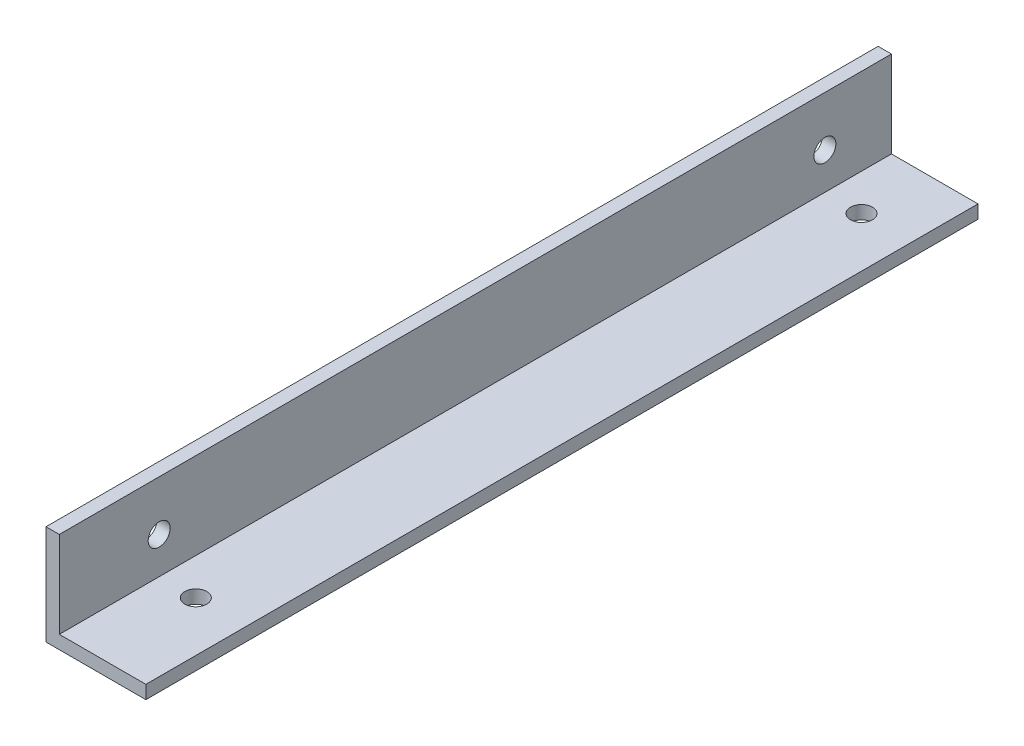
ISO-10303-21;
HEADER;
FILE_DESCRIPTION(('STEP AP214'),'2;1');
FILE_NAME('part.step','',(''),(''),'','','');
FILE_SCHEMA(('AUTOMOTIVE_DESIGN { 1 0 10303 214 1 1 1 1 }'));
ENDSEC;
DATA;
#1=APPLICATION_CONTEXT('core data for automotive mechanical design processes');
#2=APPLICATION_PROTOCOL_DEFINITION('international standard','automotive_design',2000,#1);
#3=PRODUCT_CONTEXT('',#1,'mechanical');
#4=PRODUCT('Part','Part','',(#3));
#5=PRODUCT_RELATED_PRODUCT_CATEGORY('part','',(#4));
#6=PRODUCT_DEFINITION_FORMATION('','',#4);
#7=PRODUCT_DEFINITION_CONTEXT('part definition',#1,'design');
#8=PRODUCT_DEFINITION('design','',#6,#7);
#9=PRODUCT_DEFINITION_SHAPE('','',#8);
#10=(LENGTH_UNIT() NAMED_UNIT(*) SI_UNIT(.MILLI.,.METRE.));
#11=(NAMED_UNIT(*) PLANE_ANGLE_UNIT() SI_UNIT($,.RADIAN.));
#12=(NAMED_UNIT(*) SI_UNIT($,.STERADIAN.) SOLID_ANGLE_UNIT());
#13=UNCERTAINTY_MEASURE_WITH_UNIT(LENGTH_MEASURE(1.E-05),#10,'distance_accuracy_value','');
#14=(GEOMETRIC_REPRESENTATION_CONTEXT(3) GLOBAL_UNCERTAINTY_ASSIGNED_CONTEXT((#13)) GLOBAL_UNIT_ASSIGNED_CONTEXT((#10,
#11,#12)) REPRESENTATION_CONTEXT('',''));
#15=CARTESIAN_POINT('',(0.,0.,0.));
#16=DIRECTION('',(0.,0.,1.));
#17=DIRECTION('',(1.,0.,0.));
#18=AXIS2_PLACEMENT_3D('',#15,#16,#17);
#19=CARTESIAN_POINT('',(0.,15.,125.));
#20=DIRECTION('',(1.,0.,0.));
#21=DIRECTION('',(0.,0.,-1.));
#22=AXIS2_PLACEMENT_3D('',#19,#20,#21);
#23=PLANE('',#22);
#24=CARTESIAN_POINT('',(0.,7.5,110.));
#25=DIRECTION('',(-1.,0.,0.));
#26=DIRECTION('',(0.,0.,1.));
#27=AXIS2_PLACEMENT_3D('',#24,#25,#26);
#28=CIRCLE('',#27,1.65);
#29=CARTESIAN_POINT('',(0.,7.5,111.65));
#30=VERTEX_POINT('',#29);
#31=EDGE_CURVE('E164',#30,#30,#28,.T.);
#32=ORIENTED_EDGE('',*,*,#31,.F.);
#33=EDGE_LOOP('',(#32));
#34=FACE_BOUND('',#33,.T.);
#35=CARTESIAN_POINT('',(0.,7.5,10.));
#36=DIRECTION('',(-1.,0.,0.));
#37=DIRECTION('',(0.,0.,1.));
#38=AXIS2_PLACEMENT_3D('',#35,#36,#37);
#39=CIRCLE('',#38,1.65);
#40=CARTESIAN_POINT('',(0.,7.5,11.65));
#41=VERTEX_POINT('',#40);
#42=EDGE_CURVE('E167',#41,#41,#39,.T.);
#43=ORIENTED_EDGE('',*,*,#42,.F.);
#44=EDGE_LOOP('',(#43));
#45=FACE_BOUND('',#44,.T.);
#46=DIRECTION('',(0.,-1.,0.));
#47=VECTOR('',#46,1.);
#48=CARTESIAN_POINT('',(0.,15.,0.));
#49=LINE('',#48,#47);
#50=CARTESIAN_POINT('',(0.,15.,0.));
#51=VERTEX_POINT('',#50);
#52=CARTESIAN_POINT('',(0.,0.,0.));
#53=VERTEX_POINT('',#52);
#54=EDGE_CURVE('E119',#51,#53,#49,.T.);
#55=ORIENTED_EDGE('',*,*,#54,.T.);
#56=DIRECTION('',(0.,0.,-1.));
#57=VECTOR('',#56,1.);
#58=CARTESIAN_POINT('',(0.,0.,125.));
#59=LINE('',#58,#57);
#60=CARTESIAN_POINT('',(0.,0.,125.));
#61=VERTEX_POINT('',#60);
#62=EDGE_CURVE('E11',#61,#53,#59,.T.);
#63=ORIENTED_EDGE('',*,*,#62,.F.);
#64=DIRECTION('',(0.,-1.,0.));
#65=VECTOR('',#64,1.);
#66=CARTESIAN_POINT('',(0.,15.,125.));
#67=LINE('',#66,#65);
#68=CARTESIAN_POINT('',(0.,15.,125.));
#69=VERTEX_POINT('',#68);
#70=EDGE_CURVE('E130',#69,#61,#67,.T.);
#71=ORIENTED_EDGE('',*,*,#70,.F.);
#72=DIRECTION('',(0.,0.,-1.));
#73=VECTOR('',#72,1.);
#74=CARTESIAN_POINT('',(0.,15.,125.));
#75=LINE('',#74,#73);
#76=EDGE_CURVE('E115',#69,#51,#75,.T.);
#77=ORIENTED_EDGE('',*,*,#76,.T.);
#78=EDGE_LOOP('',(#55,#63,#71,#77));
#79=FACE_BOUND('',#78,.T.);
#80=ADVANCED_FACE('F35',(#34,#45,#79),#23,.F.);
#81=CARTESIAN_POINT('',(0.,0.,125.));
#82=DIRECTION('',(0.,1.,0.));
#83=DIRECTION('',(0.,0.,1.));
#84=AXIS2_PLACEMENT_3D('',#81,#82,#83);
#85=PLANE('',#84);
#86=CARTESIAN_POINT('',(7.5,0.,10.));
#87=DIRECTION('',(0.,-1.,0.));
#88=DIRECTION('',(0.,0.,-1.));
#89=AXIS2_PLACEMENT_3D('',#86,#87,#88);
#90=CIRCLE('',#89,1.65);
#91=CARTESIAN_POINT('',(7.5,0.,8.35));
#92=VERTEX_POINT('',#91);
#93=EDGE_CURVE('E188',#92,#92,#90,.T.);
#94=ORIENTED_EDGE('',*,*,#93,.F.);
#95=EDGE_LOOP('',(#94));
#96=FACE_BOUND('',#95,.T.);
#97=CARTESIAN_POINT('',(7.49999999999999,0.,110.));
#98=DIRECTION('',(0.,-1.,0.));
#99=DIRECTION('',(0.,0.,-1.));
#100=AXIS2_PLACEMENT_3D('',#97,#98,#99);
#101=CIRCLE('',#100,1.65);
#102=CARTESIAN_POINT('',(7.49999999999999,0.,108.35));
#103=VERTEX_POINT('',#102);
#104=EDGE_CURVE('E182',#103,#103,#101,.T.);
#105=ORIENTED_EDGE('',*,*,#104,.F.);
#106=EDGE_LOOP('',(#105));
#107=FACE_BOUND('',#106,.T.);
#108=DIRECTION('',(1.,0.,0.));
#109=VECTOR('',#108,1.);
#110=CARTESIAN_POINT('',(0.,0.,0.));
#111=LINE('',#110,#109);
#112=CARTESIAN_POINT('',(15.,0.,0.));
#113=VERTEX_POINT('',#112);
#114=EDGE_CURVE('E122',#53,#113,#111,.T.);
#115=ORIENTED_EDGE('',*,*,#114,.T.);
#116=DIRECTION('',(0.,0.,-1.));
#117=VECTOR('',#116,1.);
#118=CARTESIAN_POINT('',(15.,0.,125.));
#119=LINE('',#118,#117);
#120=CARTESIAN_POINT('',(15.,0.,125.));
#121=VERTEX_POINT('',#120);
#122=EDGE_CURVE('E43',#121,#113,#119,.T.);
#123=ORIENTED_EDGE('',*,*,#122,.F.);
#124=DIRECTION('',(1.,0.,0.));
#125=VECTOR('',#124,1.);
#126=CARTESIAN_POINT('',(0.,0.,125.));
#127=LINE('',#126,#125);
#128=EDGE_CURVE('E88',#61,#121,#127,.T.);
#129=ORIENTED_EDGE('',*,*,#128,.F.);
#130=ORIENTED_EDGE('',*,*,#62,.T.);
#131=EDGE_LOOP('',(#115,#123,#129,#130));
#132=FACE_BOUND('',#131,.T.);
#133=ADVANCED_FACE('F155',(#96,#107,#132),#85,.F.);
#134=CARTESIAN_POINT('',(15.,0.,125.));
#135=DIRECTION('',(-1.,0.,0.));
#136=DIRECTION('',(0.,0.,1.));
#137=AXIS2_PLACEMENT_3D('',#134,#135,#136);
#138=PLANE('',#137);
#139=DIRECTION('',(0.,1.,0.));
#140=VECTOR('',#139,1.);
#141=CARTESIAN_POINT('',(15.,0.,0.));
#142=LINE('',#141,#140);
#143=CARTESIAN_POINT('',(15.,2.,0.));
#144=VERTEX_POINT('',#143);
#145=EDGE_CURVE('E125',#113,#144,#142,.T.);
#146=ORIENTED_EDGE('',*,*,#145,.T.);
#147=DIRECTION('',(0.,0.,-1.));
#148=VECTOR('',#147,1.);
#149=CARTESIAN_POINT('',(15.,2.,125.));
#150=LINE('',#149,#148);
#151=CARTESIAN_POINT('',(15.,2.,125.));
#152=VERTEX_POINT('',#151);
#153=EDGE_CURVE('E110',#152,#144,#150,.T.);
#154=ORIENTED_EDGE('',*,*,#153,.F.);
#155=DIRECTION('',(0.,1.,0.));
#156=VECTOR('',#155,1.);
#157=CARTESIAN_POINT('',(15.,0.,125.));
#158=LINE('',#157,#156);
#159=EDGE_CURVE('E101',#121,#152,#158,.T.);
#160=ORIENTED_EDGE('',*,*,#159,.F.);
#161=ORIENTED_EDGE('',*,*,#122,.T.);
#162=EDGE_LOOP('',(#146,#154,#160,#161));
#163=FACE_BOUND('',#162,.T.);
#164=ADVANCED_FACE('F136',(#163),#138,.F.);
#165=CARTESIAN_POINT('',(15.,2.,125.));
#166=DIRECTION('',(0.,-1.,0.));
#167=DIRECTION('',(1.,0.,0.));
#168=AXIS2_PLACEMENT_3D('',#165,#166,#167);
#169=PLANE('',#168);
#170=CARTESIAN_POINT('',(7.5,2.,10.));
#171=DIRECTION('',(0.,-1.,0.));
#172=DIRECTION('',(1.,0.,0.));
#173=AXIS2_PLACEMENT_3D('',#170,#171,#172);
#174=CIRCLE('',#173,1.65);
#175=CARTESIAN_POINT('',(9.15,2.,10.));
#176=VERTEX_POINT('',#175);
#177=EDGE_CURVE('E185',#176,#176,#174,.T.);
#178=ORIENTED_EDGE('',*,*,#177,.T.);
#179=EDGE_LOOP('',(#178));
#180=FACE_BOUND('',#179,.T.);
#181=CARTESIAN_POINT('',(7.49999999999999,2.,110.));
#182=DIRECTION('',(0.,-1.,0.));
#183=DIRECTION('',(1.,0.,0.));
#184=AXIS2_PLACEMENT_3D('',#181,#182,#183);
#185=CIRCLE('',#184,1.65);
#186=CARTESIAN_POINT('',(9.14999999999998,2.,110.));
#187=VERTEX_POINT('',#186);
#188=EDGE_CURVE('E179',#187,#187,#185,.T.);
#189=ORIENTED_EDGE('',*,*,#188,.T.);
#190=EDGE_LOOP('',(#189));
#191=FACE_BOUND('',#190,.T.);
#192=DIRECTION('',(-1.,0.,0.));
#193=VECTOR('',#192,1.);
#194=CARTESIAN_POINT('',(15.,2.,0.));
#195=LINE('',#194,#193);
#196=CARTESIAN_POINT('',(2.,2.,0.));
#197=VERTEX_POINT('',#196);
#198=EDGE_CURVE('E109',#144,#197,#195,.T.);
#199=ORIENTED_EDGE('',*,*,#198,.T.);
#200=DIRECTION('',(0.,0.,-1.));
#201=VECTOR('',#200,1.);
#202=CARTESIAN_POINT('',(2.,2.,125.));
#203=LINE('',#202,#201);
#204=CARTESIAN_POINT('',(2.,2.,125.));
#205=VERTEX_POINT('',#204);
#206=EDGE_CURVE('E106',#205,#197,#203,.T.);
#207=ORIENTED_EDGE('',*,*,#206,.F.);
#208=DIRECTION('',(-1.,0.,0.));
#209=VECTOR('',#208,1.);
#210=CARTESIAN_POINT('',(15.,2.,125.));
#211=LINE('',#210,#209);
#212=EDGE_CURVE('E95',#152,#205,#211,.T.);
#213=ORIENTED_EDGE('',*,*,#212,.F.);
#214=ORIENTED_EDGE('',*,*,#153,.T.);
#215=EDGE_LOOP('',(#199,#207,#213,#214));
#216=FACE_BOUND('',#215,.T.);
#217=ADVANCED_FACE('F107',(#180,#191,#216),#169,.F.);
#218=CARTESIAN_POINT('',(2.,2.,125.));
#219=DIRECTION('',(-1.,0.,0.));
#220=DIRECTION('',(0.,0.,1.));
#221=AXIS2_PLACEMENT_3D('',#218,#219,#220);
#222=PLANE('',#221);
#223=CARTESIAN_POINT('',(2.,7.5,110.));
#224=DIRECTION('',(-1.,0.,0.));
#225=DIRECTION('',(0.,0.,1.));
#226=AXIS2_PLACEMENT_3D('',#223,#224,#225);
#227=CIRCLE('',#226,1.65);
#228=CARTESIAN_POINT('',(2.,7.5,111.65));
#229=VERTEX_POINT('',#228);
#230=EDGE_CURVE('E169',#229,#229,#227,.T.);
#231=ORIENTED_EDGE('',*,*,#230,.T.);
#232=EDGE_LOOP('',(#231));
#233=FACE_BOUND('',#232,.T.);
#234=CARTESIAN_POINT('',(2.,7.5,10.));
#235=DIRECTION('',(-1.,0.,0.));
#236=DIRECTION('',(0.,0.,1.));
#237=AXIS2_PLACEMENT_3D('',#234,#235,#236);
#238=CIRCLE('',#237,1.65);
#239=CARTESIAN_POINT('',(2.,7.5,11.65));
#240=VERTEX_POINT('',#239);
#241=EDGE_CURVE('E123',#240,#240,#238,.T.);
#242=ORIENTED_EDGE('',*,*,#241,.T.);
#243=EDGE_LOOP('',(#242));
#244=FACE_BOUND('',#243,.T.);
#245=DIRECTION('',(0.,1.,0.));
#246=VECTOR('',#245,1.);
#247=CARTESIAN_POINT('',(2.,2.,0.));
#248=LINE('',#247,#246);
#249=CARTESIAN_POINT('',(2.,15.,0.));
#250=VERTEX_POINT('',#249);
#251=EDGE_CURVE('E74',#197,#250,#248,.T.);
#252=ORIENTED_EDGE('',*,*,#251,.T.);
#253=DIRECTION('',(0.,0.,-1.));
#254=VECTOR('',#253,1.);
#255=CARTESIAN_POINT('',(2.,15.,125.));
#256=LINE('',#255,#254);
#257=CARTESIAN_POINT('',(2.,15.,125.));
#258=VERTEX_POINT('',#257);
#259=EDGE_CURVE('E111',#258,#250,#256,.T.);
#260=ORIENTED_EDGE('',*,*,#259,.F.);
#261=DIRECTION('',(0.,1.,0.));
#262=VECTOR('',#261,1.);
#263=CARTESIAN_POINT('',(2.,2.,125.));
#264=LINE('',#263,#262);
#265=EDGE_CURVE('E99',#205,#258,#264,.T.);
#266=ORIENTED_EDGE('',*,*,#265,.F.);
#267=ORIENTED_EDGE('',*,*,#206,.T.);
#268=EDGE_LOOP('',(#252,#260,#266,#267));
#269=FACE_BOUND('',#268,.T.);
#270=ADVANCED_FACE('F113',(#233,#244,#269),#222,.F.);
#271=CARTESIAN_POINT('',(2.,15.,125.));
#272=DIRECTION('',(0.,-1.,0.));
#273=DIRECTION('',(0.,0.,-1.));
#274=AXIS2_PLACEMENT_3D('',#271,#272,#273);
#275=PLANE('',#274);
#276=DIRECTION('',(-1.,0.,0.));
#277=VECTOR('',#276,1.);
#278=CARTESIAN_POINT('',(2.,15.,0.));
#279=LINE('',#278,#277);
#280=EDGE_CURVE('E80',#250,#51,#279,.T.);
#281=ORIENTED_EDGE('',*,*,#280,.T.);
#282=ORIENTED_EDGE('',*,*,#76,.F.);
#283=DIRECTION('',(-1.,0.,0.));
#284=VECTOR('',#283,1.);
#285=CARTESIAN_POINT('',(2.,15.,125.));
#286=LINE('',#285,#284);
#287=EDGE_CURVE('E51',#258,#69,#286,.T.);
#288=ORIENTED_EDGE('',*,*,#287,.F.);
#289=ORIENTED_EDGE('',*,*,#259,.T.);
#290=EDGE_LOOP('',(#281,#282,#288,#289));
#291=FACE_BOUND('',#290,.T.);
#292=ADVANCED_FACE('F143',(#291),#275,.F.);
#293=CARTESIAN_POINT('',(0.,0.,125.));
#294=DIRECTION('',(0.,0.,1.));
#295=DIRECTION('',(1.,0.,0.));
#296=AXIS2_PLACEMENT_3D('',#293,#294,#295);
#297=PLANE('',#296);
#298=ORIENTED_EDGE('',*,*,#70,.T.);
#299=ORIENTED_EDGE('',*,*,#128,.T.);
#300=ORIENTED_EDGE('',*,*,#159,.T.);
#301=ORIENTED_EDGE('',*,*,#212,.T.);
#302=ORIENTED_EDGE('',*,*,#265,.T.);
#303=ORIENTED_EDGE('',*,*,#287,.T.);
#304=EDGE_LOOP('',(#298,#299,#300,#301,#302,#303));
#305=FACE_BOUND('',#304,.T.);
#306=ADVANCED_FACE('F97',(#305),#297,.T.);
#307=CARTESIAN_POINT('',(0.,0.,0.));
#308=DIRECTION('',(0.,0.,1.));
#309=DIRECTION('',(1.,0.,0.));
#310=AXIS2_PLACEMENT_3D('',#307,#308,#309);
#311=PLANE('',#310);
#312=ORIENTED_EDGE('',*,*,#54,.F.);
#313=ORIENTED_EDGE('',*,*,#280,.F.);
#314=ORIENTED_EDGE('',*,*,#251,.F.);
#315=ORIENTED_EDGE('',*,*,#198,.F.);
#316=ORIENTED_EDGE('',*,*,#145,.F.);
#317=ORIENTED_EDGE('',*,*,#114,.F.);
#318=EDGE_LOOP('',(#312,#313,#314,#315,#316,#317));
#319=FACE_BOUND('',#318,.T.);
#320=ADVANCED_FACE('F139',(#319),#311,.F.);
#321=CARTESIAN_POINT('',(0.,7.5,10.));
#322=DIRECTION('',(-1.,0.,0.));
#323=DIRECTION('',(0.,0.,1.));
#324=AXIS2_PLACEMENT_3D('',#321,#322,#323);
#325=CYLINDRICAL_SURFACE('',#324,1.65);
#326=ORIENTED_EDGE('',*,*,#42,.T.);
#327=EDGE_LOOP('',(#326));
#328=FACE_BOUND('',#327,.T.);
#329=ORIENTED_EDGE('',*,*,#241,.F.);
#330=EDGE_LOOP('',(#329));
#331=FACE_BOUND('',#330,.T.);
#332=ADVANCED_FACE('F219',(#328,#331),#325,.F.);
#333=CARTESIAN_POINT('',(0.,7.5,110.));
#334=DIRECTION('',(-1.,0.,0.));
#335=DIRECTION('',(0.,0.,1.));
#336=AXIS2_PLACEMENT_3D('',#333,#334,#335);
#337=CYLINDRICAL_SURFACE('',#336,1.65);
#338=ORIENTED_EDGE('',*,*,#31,.T.);
#339=EDGE_LOOP('',(#338));
#340=FACE_BOUND('',#339,.T.);
#341=ORIENTED_EDGE('',*,*,#230,.F.);
#342=EDGE_LOOP('',(#341));
#343=FACE_BOUND('',#342,.T.);
#344=ADVANCED_FACE('F200',(#340,#343),#337,.F.);
#345=CARTESIAN_POINT('',(7.49999999999999,0.,110.));
#346=DIRECTION('',(0.,-1.,0.));
#347=DIRECTION('',(0.,0.,-1.));
#348=AXIS2_PLACEMENT_3D('',#345,#346,#347);
#349=CYLINDRICAL_SURFACE('',#348,1.65);
#350=ORIENTED_EDGE('',*,*,#104,.T.);
#351=EDGE_LOOP('',(#350));
#352=FACE_BOUND('',#351,.T.);
#353=ORIENTED_EDGE('',*,*,#188,.F.);
#354=EDGE_LOOP('',(#353));
#355=FACE_BOUND('',#354,.T.);
#356=ADVANCED_FACE('F197',(#352,#355),#349,.F.);
#357=CARTESIAN_POINT('',(7.5,0.,10.));
#358=DIRECTION('',(0.,-1.,0.));
#359=DIRECTION('',(0.,0.,-1.));
#360=AXIS2_PLACEMENT_3D('',#357,#358,#359);
#361=CYLINDRICAL_SURFACE('',#360,1.65);
#362=ORIENTED_EDGE('',*,*,#93,.T.);
#363=EDGE_LOOP('',(#362));
#364=FACE_BOUND('',#363,.T.);
#365=ORIENTED_EDGE('',*,*,#177,.F.);
#366=EDGE_LOOP('',(#365));
#367=FACE_BOUND('',#366,.T.);
#368=ADVANCED_FACE('F192',(#364,#367),#361,.F.);
#369=CLOSED_SHELL('',(#80,#133,#164,#217,#270,#292,#306,#320,#332,#344,#356,#368));
#370=MANIFOLD_SOLID_BREP('B2',#369);
#371=ADVANCED_BREP_SHAPE_REPRESENTATION('',(#18,#370),#14);
#372=SHAPE_DEFINITION_REPRESENTATION(#9,#371);
ENDSEC;
END-ISO-10303-21;
